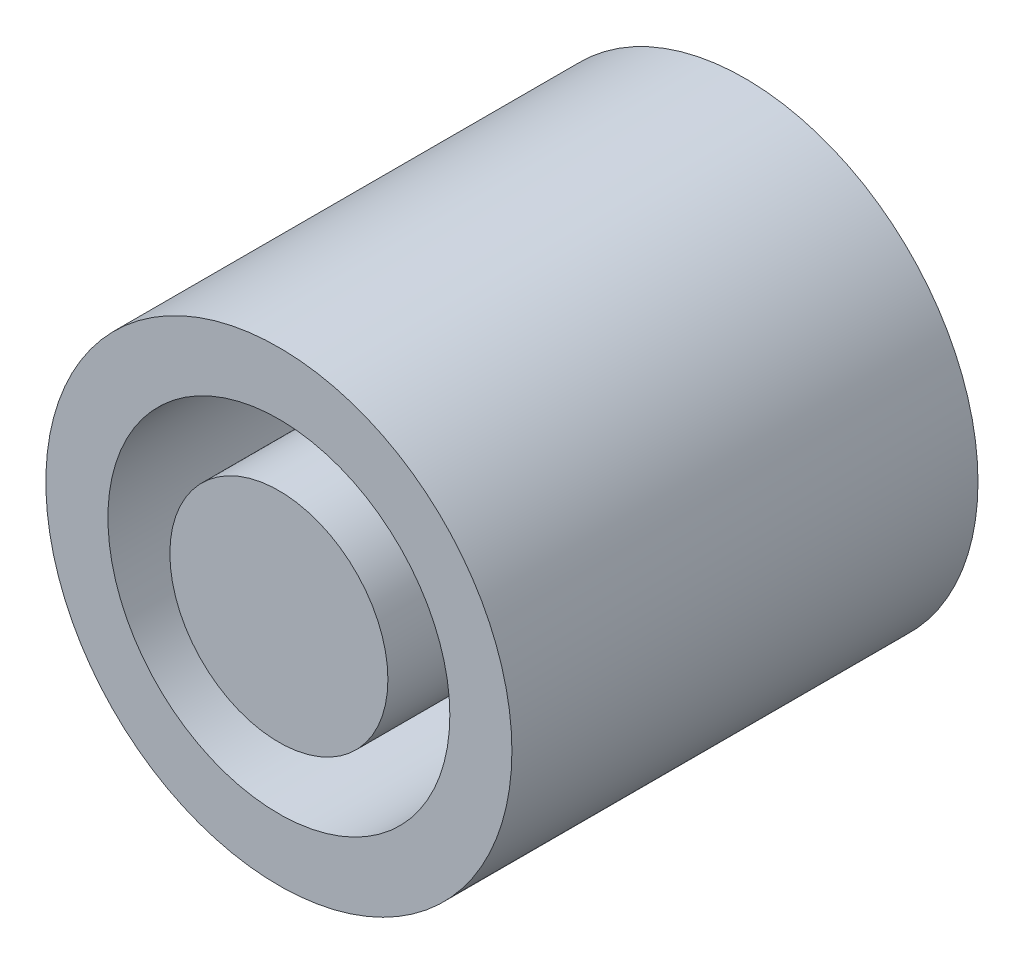
ISO-10303-21;
HEADER;
FILE_DESCRIPTION(('STEP AP214'),'2;1');
FILE_NAME('part.step','',(''),(''),'','','');
FILE_SCHEMA(('AUTOMOTIVE_DESIGN { 1 0 10303 214 1 1 1 1 }'));
ENDSEC;
DATA;
#1=APPLICATION_CONTEXT('core data for automotive mechanical design processes');
#2=APPLICATION_PROTOCOL_DEFINITION('international standard','automotive_design',2000,#1);
#3=PRODUCT_CONTEXT('',#1,'mechanical');
#4=PRODUCT('Part','Part','',(#3));
#5=PRODUCT_RELATED_PRODUCT_CATEGORY('part','',(#4));
#6=PRODUCT_DEFINITION_FORMATION('','',#4);
#7=PRODUCT_DEFINITION_CONTEXT('part definition',#1,'design');
#8=PRODUCT_DEFINITION('design','',#6,#7);
#9=PRODUCT_DEFINITION_SHAPE('','',#8);
#10=(LENGTH_UNIT() NAMED_UNIT(*) SI_UNIT(.MILLI.,.METRE.));
#11=(NAMED_UNIT(*) PLANE_ANGLE_UNIT() SI_UNIT($,.RADIAN.));
#12=(NAMED_UNIT(*) SI_UNIT($,.STERADIAN.) SOLID_ANGLE_UNIT());
#13=UNCERTAINTY_MEASURE_WITH_UNIT(LENGTH_MEASURE(1.E-05),#10,'distance_accuracy_value','');
#14=(GEOMETRIC_REPRESENTATION_CONTEXT(3) GLOBAL_UNCERTAINTY_ASSIGNED_CONTEXT((#13)) GLOBAL_UNIT_ASSIGNED_CONTEXT((#10,
#11,#12)) REPRESENTATION_CONTEXT('',''));
#15=CARTESIAN_POINT('',(0.,0.,0.));
#16=DIRECTION('',(0.,0.,1.));
#17=DIRECTION('',(1.,0.,0.));
#18=AXIS2_PLACEMENT_3D('',#15,#16,#17);
#19=CARTESIAN_POINT('',(0.,0.,-0.05));
#20=DIRECTION('',(0.,0.,1.));
#21=DIRECTION('',(1.,0.,0.));
#22=AXIS2_PLACEMENT_3D('',#19,#20,#21);
#23=CYLINDRICAL_SURFACE('',#22,0.0250000000000001);
#24=CARTESIAN_POINT('',(0.,0.,-0.05));
#25=DIRECTION('',(0.,0.,1.));
#26=DIRECTION('',(1.,0.,0.));
#27=AXIS2_PLACEMENT_3D('',#24,#25,#26);
#28=CIRCLE('',#27,0.0250000000000001);
#29=CARTESIAN_POINT('',(0.0250000000000001,0.,-0.05));
#30=VERTEX_POINT('',#29);
#31=EDGE_CURVE('E10',#30,#30,#28,.T.);
#32=ORIENTED_EDGE('',*,*,#31,.T.);
#33=EDGE_LOOP('',(#32));
#34=FACE_BOUND('',#33,.T.);
#35=CARTESIAN_POINT('',(0.,0.,0.));
#36=DIRECTION('',(0.,0.,1.));
#37=DIRECTION('',(1.,0.,0.));
#38=AXIS2_PLACEMENT_3D('',#35,#36,#37);
#39=CIRCLE('',#38,0.0250000000000001);
#40=CARTESIAN_POINT('',(0.0250000000000001,0.,0.));
#41=VERTEX_POINT('',#40);
#42=EDGE_CURVE('E31',#41,#41,#39,.T.);
#43=ORIENTED_EDGE('',*,*,#42,.F.);
#44=EDGE_LOOP('',(#43));
#45=FACE_BOUND('',#44,.T.);
#46=ADVANCED_FACE('F28',(#34,#45),#23,.T.);
#47=CARTESIAN_POINT('',(0.,0.,-0.05));
#48=DIRECTION('',(0.,0.,1.));
#49=DIRECTION('',(1.,0.,0.));
#50=AXIS2_PLACEMENT_3D('',#47,#48,#49);
#51=PLANE('',#50);
#52=ORIENTED_EDGE('',*,*,#31,.F.);
#53=EDGE_LOOP('',(#52));
#54=FACE_BOUND('',#53,.T.);
#55=ADVANCED_FACE('F70',(#54),#51,.F.);
#56=CARTESIAN_POINT('',(0.,0.,0.));
#57=DIRECTION('',(0.,0.,1.));
#58=DIRECTION('',(1.,0.,0.));
#59=AXIS2_PLACEMENT_3D('',#56,#57,#58);
#60=PLANE('',#59);
#61=CARTESIAN_POINT('',(0.,0.,0.));
#62=DIRECTION('',(0.,0.,1.));
#63=DIRECTION('',(1.,0.,0.));
#64=AXIS2_PLACEMENT_3D('',#61,#62,#63);
#65=CIRCLE('',#64,0.0183403581172267);
#66=CARTESIAN_POINT('',(0.0183403581172267,0.,0.));
#67=VERTEX_POINT('',#66);
#68=EDGE_CURVE('E40',#67,#67,#65,.T.);
#69=ORIENTED_EDGE('',*,*,#68,.F.);
#70=EDGE_LOOP('',(#69));
#71=FACE_BOUND('',#70,.T.);
#72=ORIENTED_EDGE('',*,*,#42,.T.);
#73=EDGE_LOOP('',(#72));
#74=FACE_BOUND('',#73,.T.);
#75=ADVANCED_FACE('F64',(#71,#74),#60,.T.);
#76=CARTESIAN_POINT('',(0.,0.,-0.04));
#77=DIRECTION('',(0.,0.,1.));
#78=DIRECTION('',(1.,0.,0.));
#79=AXIS2_PLACEMENT_3D('',#76,#77,#78);
#80=CYLINDRICAL_SURFACE('',#79,0.0183403581172267);
#81=CARTESIAN_POINT('',(0.,0.,-0.04));
#82=DIRECTION('',(0.,0.,1.));
#83=DIRECTION('',(1.,0.,0.));
#84=AXIS2_PLACEMENT_3D('',#81,#82,#83);
#85=CIRCLE('',#84,0.0183403581172267);
#86=CARTESIAN_POINT('',(0.0183403581172267,0.,-0.04));
#87=VERTEX_POINT('',#86);
#88=EDGE_CURVE('E38',#87,#87,#85,.T.);
#89=ORIENTED_EDGE('',*,*,#88,.F.);
#90=EDGE_LOOP('',(#89));
#91=FACE_BOUND('',#90,.T.);
#92=ORIENTED_EDGE('',*,*,#68,.T.);
#93=EDGE_LOOP('',(#92));
#94=FACE_BOUND('',#93,.T.);
#95=ADVANCED_FACE('F58',(#91,#94),#80,.F.);
#96=CARTESIAN_POINT('',(0.,0.,-0.04));
#97=DIRECTION('',(0.,0.,1.));
#98=DIRECTION('',(1.,0.,0.));
#99=AXIS2_PLACEMENT_3D('',#96,#97,#98);
#100=PLANE('',#99);
#101=CARTESIAN_POINT('',(0.,0.,-0.04));
#102=DIRECTION('',(0.,0.,1.));
#103=DIRECTION('',(1.,0.,0.));
#104=AXIS2_PLACEMENT_3D('',#101,#102,#103);
#105=CIRCLE('',#104,0.0116951716049848);
#106=CARTESIAN_POINT('',(0.0116951716049848,0.,-0.04));
#107=VERTEX_POINT('',#106);
#108=EDGE_CURVE('E43',#107,#107,#105,.T.);
#109=ORIENTED_EDGE('',*,*,#108,.F.);
#110=EDGE_LOOP('',(#109));
#111=FACE_BOUND('',#110,.T.);
#112=ORIENTED_EDGE('',*,*,#88,.T.);
#113=EDGE_LOOP('',(#112));
#114=FACE_BOUND('',#113,.T.);
#115=ADVANCED_FACE('F55',(#111,#114),#100,.T.);
#116=CARTESIAN_POINT('',(0.,0.,-0.04));
#117=DIRECTION('',(0.,0.,1.));
#118=DIRECTION('',(1.,0.,0.));
#119=AXIS2_PLACEMENT_3D('',#116,#117,#118);
#120=CYLINDRICAL_SURFACE('',#119,0.0116951716049848);
#121=ORIENTED_EDGE('',*,*,#108,.T.);
#122=EDGE_LOOP('',(#121));
#123=FACE_BOUND('',#122,.T.);
#124=CARTESIAN_POINT('',(0.,0.,0.));
#125=DIRECTION('',(0.,0.,1.));
#126=DIRECTION('',(1.,0.,0.));
#127=AXIS2_PLACEMENT_3D('',#124,#125,#126);
#128=CIRCLE('',#127,0.0116951716049848);
#129=CARTESIAN_POINT('',(0.0116951716049848,0.,0.));
#130=VERTEX_POINT('',#129);
#131=EDGE_CURVE('E46',#130,#130,#128,.T.);
#132=ORIENTED_EDGE('',*,*,#131,.F.);
#133=EDGE_LOOP('',(#132));
#134=FACE_BOUND('',#133,.T.);
#135=ADVANCED_FACE('F52',(#123,#134),#120,.T.);
#136=ORIENTED_EDGE('',*,*,#131,.T.);
#137=EDGE_LOOP('',(#136));
#138=FACE_BOUND('',#137,.T.);
#139=ADVANCED_FACE('F71',(#138),#60,.T.);
#140=CLOSED_SHELL('',(#46,#55,#75,#95,#115,#135,#139));
#141=MANIFOLD_SOLID_BREP('B2',#140);
#142=ADVANCED_BREP_SHAPE_REPRESENTATION('',(#18,#141),#14);
#143=SHAPE_DEFINITION_REPRESENTATION(#9,#142);
ENDSEC;
END-ISO-10303-21;
